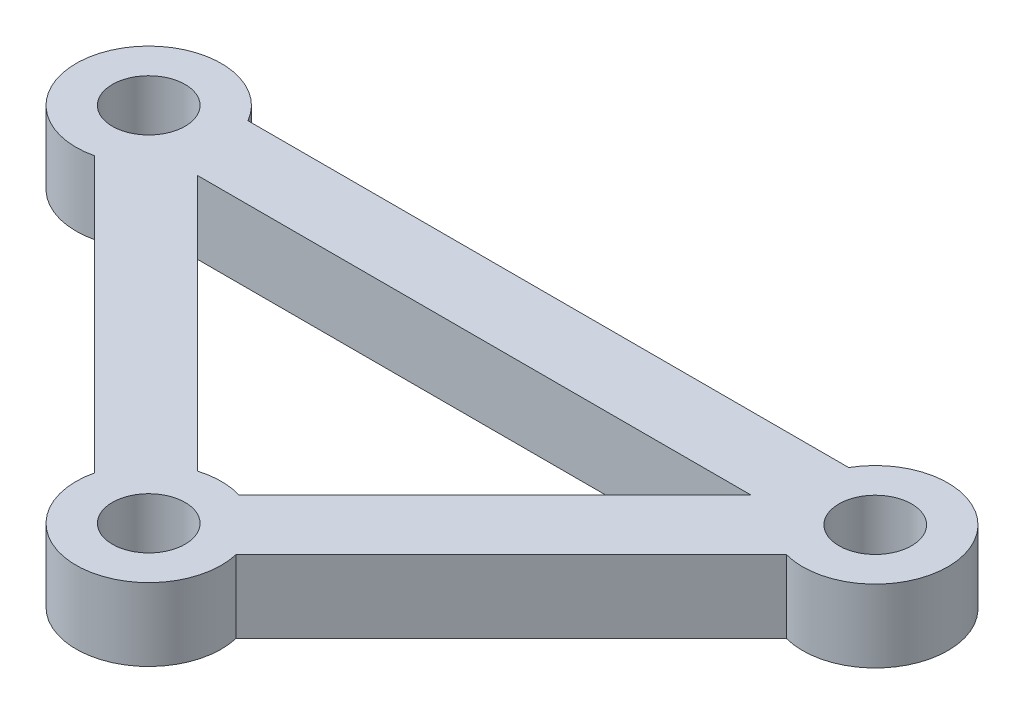
ISO-10303-21;
HEADER;
FILE_DESCRIPTION(('STEP AP214'),'2;1');
FILE_NAME('part.step','',(''),(''),'','','');
FILE_SCHEMA(('AUTOMOTIVE_DESIGN { 1 0 10303 214 1 1 1 1 }'));
ENDSEC;
DATA;
#1=APPLICATION_CONTEXT('core data for automotive mechanical design processes');
#2=APPLICATION_PROTOCOL_DEFINITION('international standard','automotive_design',2000,#1);
#3=PRODUCT_CONTEXT('',#1,'mechanical');
#4=PRODUCT('Part','Part','',(#3));
#5=PRODUCT_RELATED_PRODUCT_CATEGORY('part','',(#4));
#6=PRODUCT_DEFINITION_FORMATION('','',#4);
#7=PRODUCT_DEFINITION_CONTEXT('part definition',#1,'design');
#8=PRODUCT_DEFINITION('design','',#6,#7);
#9=PRODUCT_DEFINITION_SHAPE('','',#8);
#10=(LENGTH_UNIT() NAMED_UNIT(*) SI_UNIT(.MILLI.,.METRE.));
#11=(NAMED_UNIT(*) PLANE_ANGLE_UNIT() SI_UNIT($,.RADIAN.));
#12=(NAMED_UNIT(*) SI_UNIT($,.STERADIAN.) SOLID_ANGLE_UNIT());
#13=UNCERTAINTY_MEASURE_WITH_UNIT(LENGTH_MEASURE(1.E-05),#10,'distance_accuracy_value','');
#14=(GEOMETRIC_REPRESENTATION_CONTEXT(3) GLOBAL_UNCERTAINTY_ASSIGNED_CONTEXT((#13)) GLOBAL_UNIT_ASSIGNED_CONTEXT((#10,
#11,#12)) REPRESENTATION_CONTEXT('',''));
#15=CARTESIAN_POINT('',(0.,0.,0.));
#16=DIRECTION('',(0.,0.,1.));
#17=DIRECTION('',(1.,0.,0.));
#18=AXIS2_PLACEMENT_3D('',#15,#16,#17);
#19=CARTESIAN_POINT('',(-36.6,5.,-18.4290320670353));
#20=DIRECTION('',(0.,1.,0.));
#21=DIRECTION('',(0.,0.,1.));
#22=AXIS2_PLACEMENT_3D('',#19,#20,#21);
#23=PLANE('',#22);
#24=CARTESIAN_POINT('',(13.4,5.,-18.4290320670353));
#25=DIRECTION('',(0.,1.,0.));
#26=DIRECTION('',(0.,0.,1.));
#27=AXIS2_PLACEMENT_3D('',#24,#25,#26);
#28=CIRCLE('',#27,2.49999999999999);
#29=CARTESIAN_POINT('',(13.4,5.,-15.9290320670353));
#30=VERTEX_POINT('',#29);
#31=EDGE_CURVE('E262',#30,#30,#28,.T.);
#32=ORIENTED_EDGE('',*,*,#31,.F.);
#33=EDGE_LOOP('',(#32));
#34=FACE_BOUND('',#33,.T.);
#35=CARTESIAN_POINT('',(-36.6,5.,-18.4290320670353));
#36=DIRECTION('',(0.,1.,0.));
#37=DIRECTION('',(0.,0.,1.));
#38=AXIS2_PLACEMENT_3D('',#35,#36,#37);
#39=CIRCLE('',#38,2.49999999999999);
#40=CARTESIAN_POINT('',(-36.6,5.,-15.9290320670353));
#41=VERTEX_POINT('',#40);
#42=EDGE_CURVE('E264',#41,#41,#39,.T.);
#43=ORIENTED_EDGE('',*,*,#42,.F.);
#44=EDGE_LOOP('',(#43));
#45=FACE_BOUND('',#44,.T.);
#46=CARTESIAN_POINT('',(-11.6900924905343,5.,6.48054959979383));
#47=DIRECTION('',(0.,1.,0.));
#48=DIRECTION('',(0.,0.,1.));
#49=AXIS2_PLACEMENT_3D('',#46,#47,#48);
#50=CIRCLE('',#49,2.49999999999999);
#51=CARTESIAN_POINT('',(-11.6900924905343,5.,8.98054959979382));
#52=VERTEX_POINT('',#51);
#53=EDGE_CURVE('E272',#52,#52,#50,.T.);
#54=ORIENTED_EDGE('',*,*,#53,.F.);
#55=EDGE_LOOP('',(#54));
#56=FACE_BOUND('',#55,.T.);
#57=CARTESIAN_POINT('',(-36.6,5.,-18.4290320670353));
#58=DIRECTION('',(0.,1.,0.));
#59=DIRECTION('',(0.,0.,1.));
#60=AXIS2_PLACEMENT_3D('',#57,#58,#59);
#61=CIRCLE('',#60,5.);
#62=CARTESIAN_POINT('',(-32.2698729810778,5.,-20.9290320670353));
#63=VERTEX_POINT('',#62);
#64=CARTESIAN_POINT('',(-35.4498105263129,5.,-13.5631237063467));
#65=VERTEX_POINT('',#64);
#66=EDGE_CURVE('E148',#63,#65,#61,.T.);
#67=ORIENTED_EDGE('',*,*,#66,.T.);
#68=DIRECTION('',(0.707106781186549,0.,0.707106781186546));
#69=VECTOR('',#68,1.);
#70=CARTESIAN_POINT('',(-35.4498105263129,5.,-13.5631237063467));
#71=LINE('',#70,#69);
#72=CARTESIAN_POINT('',(-16.55606314145,5.,5.33062367851603));
#73=VERTEX_POINT('',#72);
#74=EDGE_CURVE('E151',#65,#73,#71,.T.);
#75=ORIENTED_EDGE('',*,*,#74,.T.);
#76=CARTESIAN_POINT('',(-11.6900924905343,5.,6.48054959979383));
#77=DIRECTION('',(0.,1.,0.));
#78=DIRECTION('',(0.,0.,1.));
#79=AXIS2_PLACEMENT_3D('',#76,#77,#78);
#80=CIRCLE('',#79,4.99999999999999);
#81=CARTESIAN_POINT('',(-6.82412183961866,5.,5.33062367851576));
#82=VERTEX_POINT('',#81);
#83=EDGE_CURVE('E154',#73,#82,#80,.T.);
#84=ORIENTED_EDGE('',*,*,#83,.T.);
#85=DIRECTION('',(0.707106781186553,0.,-0.707106781186542));
#86=VECTOR('',#85,1.);
#87=CARTESIAN_POINT('',(12.1059047744874,5.,-13.59940293559));
#88=LINE('',#87,#86);
#89=CARTESIAN_POINT('',(12.1059047744874,5.,-13.59940293559));
#90=VERTEX_POINT('',#89);
#91=EDGE_CURVE('E156',#82,#90,#88,.T.);
#92=ORIENTED_EDGE('',*,*,#91,.T.);
#93=CARTESIAN_POINT('',(13.4,5.,-18.4290320670353));
#94=DIRECTION('',(0.,1.,0.));
#95=DIRECTION('',(0.,0.,1.));
#96=AXIS2_PLACEMENT_3D('',#93,#94,#95);
#97=CIRCLE('',#96,5.);
#98=CARTESIAN_POINT('',(9.06987298107782,5.,-20.9290320670353));
#99=VERTEX_POINT('',#98);
#100=EDGE_CURVE('E158',#90,#99,#97,.T.);
#101=ORIENTED_EDGE('',*,*,#100,.T.);
#102=DIRECTION('',(-1.,0.,0.));
#103=VECTOR('',#102,1.);
#104=CARTESIAN_POINT('',(-32.2698729810778,5.,-20.9290320670353));
#105=LINE('',#104,#103);
#106=EDGE_CURVE('E160',#99,#63,#105,.T.);
#107=ORIENTED_EDGE('',*,*,#106,.T.);
#108=EDGE_LOOP('',(#67,#75,#84,#92,#101,#107));
#109=FACE_BOUND('',#108,.T.);
#110=CARTESIAN_POINT('',(-11.6900924905343,5.,6.48054959979383));
#111=DIRECTION('',(0.,-1.,0.));
#112=DIRECTION('',(0.,0.,1.));
#113=AXIS2_PLACEMENT_3D('',#110,#111,#112);
#114=CIRCLE('',#113,5.00000000000001);
#115=CARTESIAN_POINT('',(-13.1248076489767,5.,1.6908113591239));
#116=VERTEX_POINT('',#115);
#117=CARTESIAN_POINT('',(-10.2553773320922,5.,1.69081135912383));
#118=VERTEX_POINT('',#117);
#119=EDGE_CURVE('E118',#116,#118,#114,.T.);
#120=ORIENTED_EDGE('',*,*,#119,.F.);
#121=DIRECTION('',(0.70710678118655,0.,0.707106781186545));
#122=VECTOR('',#121,1.);
#123=CARTESIAN_POINT('',(-30.744651075136,5.,-15.9290320670353));
#124=LINE('',#123,#122);
#125=CARTESIAN_POINT('',(-30.744651075136,5.,-15.9290320670353));
#126=VERTEX_POINT('',#125);
#127=EDGE_CURVE('E110',#126,#116,#124,.T.);
#128=ORIENTED_EDGE('',*,*,#127,.F.);
#129=DIRECTION('',(-1.,0.,0.));
#130=VECTOR('',#129,1.);
#131=CARTESIAN_POINT('',(-30.744651075136,5.,-15.9290320670353));
#132=LINE('',#131,#130);
#133=CARTESIAN_POINT('',(7.36446609406724,5.,-15.9290320670353));
#134=VERTEX_POINT('',#133);
#135=EDGE_CURVE('E132',#134,#126,#132,.T.);
#136=ORIENTED_EDGE('',*,*,#135,.F.);
#137=DIRECTION('',(0.707106781186554,0.,-0.707106781186541));
#138=VECTOR('',#137,1.);
#139=CARTESIAN_POINT('',(7.36446609406724,5.,-15.9290320670353));
#140=LINE('',#139,#138);
#141=EDGE_CURVE('E130',#118,#134,#140,.T.);
#142=ORIENTED_EDGE('',*,*,#141,.F.);
#143=EDGE_LOOP('',(#120,#128,#136,#142));
#144=FACE_BOUND('',#143,.T.);
#145=ADVANCED_FACE('F33',(#34,#45,#56,#109,#144),#23,.T.);
#146=CARTESIAN_POINT('',(-36.6,0.,-18.4290320670353));
#147=DIRECTION('',(0.,1.,0.));
#148=DIRECTION('',(0.,0.,1.));
#149=AXIS2_PLACEMENT_3D('',#146,#147,#148);
#150=PLANE('',#149);
#151=CARTESIAN_POINT('',(13.4,0.,-18.4290320670353));
#152=DIRECTION('',(0.,1.,0.));
#153=DIRECTION('',(0.,0.,1.));
#154=AXIS2_PLACEMENT_3D('',#151,#152,#153);
#155=CIRCLE('',#154,2.5);
#156=CARTESIAN_POINT('',(13.4,0.,-15.9290320670353));
#157=VERTEX_POINT('',#156);
#158=EDGE_CURVE('E260',#157,#157,#155,.T.);
#159=ORIENTED_EDGE('',*,*,#158,.T.);
#160=EDGE_LOOP('',(#159));
#161=FACE_BOUND('',#160,.T.);
#162=CARTESIAN_POINT('',(-36.6,0.,-18.4290320670353));
#163=DIRECTION('',(0.,1.,0.));
#164=DIRECTION('',(0.,0.,1.));
#165=AXIS2_PLACEMENT_3D('',#162,#163,#164);
#166=CIRCLE('',#165,2.5);
#167=CARTESIAN_POINT('',(-36.6,0.,-15.9290320670353));
#168=VERTEX_POINT('',#167);
#169=EDGE_CURVE('E269',#168,#168,#166,.T.);
#170=ORIENTED_EDGE('',*,*,#169,.T.);
#171=EDGE_LOOP('',(#170));
#172=FACE_BOUND('',#171,.T.);
#173=CARTESIAN_POINT('',(-11.6900924905343,0.,6.48054959979383));
#174=DIRECTION('',(0.,1.,0.));
#175=DIRECTION('',(0.,0.,1.));
#176=AXIS2_PLACEMENT_3D('',#173,#174,#175);
#177=CIRCLE('',#176,2.5);
#178=CARTESIAN_POINT('',(-11.6900924905343,0.,8.98054959979383));
#179=VERTEX_POINT('',#178);
#180=EDGE_CURVE('E138',#179,#179,#177,.T.);
#181=ORIENTED_EDGE('',*,*,#180,.T.);
#182=EDGE_LOOP('',(#181));
#183=FACE_BOUND('',#182,.T.);
#184=CARTESIAN_POINT('',(-36.6,0.,-18.4290320670353));
#185=DIRECTION('',(0.,1.,0.));
#186=DIRECTION('',(0.,0.,1.));
#187=AXIS2_PLACEMENT_3D('',#184,#185,#186);
#188=CIRCLE('',#187,5.);
#189=CARTESIAN_POINT('',(-32.2698729810778,0.,-20.9290320670353));
#190=VERTEX_POINT('',#189);
#191=CARTESIAN_POINT('',(-35.4498105263129,0.,-13.5631237063467));
#192=VERTEX_POINT('',#191);
#193=EDGE_CURVE('E126',#190,#192,#188,.T.);
#194=ORIENTED_EDGE('',*,*,#193,.F.);
#195=DIRECTION('',(-1.,0.,0.));
#196=VECTOR('',#195,1.);
#197=CARTESIAN_POINT('',(-32.2698729810778,0.,-20.9290320670353));
#198=LINE('',#197,#196);
#199=CARTESIAN_POINT('',(9.06987298107782,0.,-20.9290320670353));
#200=VERTEX_POINT('',#199);
#201=EDGE_CURVE('E152',#200,#190,#198,.T.);
#202=ORIENTED_EDGE('',*,*,#201,.F.);
#203=CARTESIAN_POINT('',(13.4,0.,-18.4290320670353));
#204=DIRECTION('',(0.,1.,0.));
#205=DIRECTION('',(0.,0.,1.));
#206=AXIS2_PLACEMENT_3D('',#203,#204,#205);
#207=CIRCLE('',#206,5.);
#208=CARTESIAN_POINT('',(12.1059047744874,0.,-13.59940293559));
#209=VERTEX_POINT('',#208);
#210=EDGE_CURVE('E171',#209,#200,#207,.T.);
#211=ORIENTED_EDGE('',*,*,#210,.F.);
#212=DIRECTION('',(0.707106781186553,0.,-0.707106781186542));
#213=VECTOR('',#212,1.);
#214=CARTESIAN_POINT('',(12.1059047744874,0.,-13.59940293559));
#215=LINE('',#214,#213);
#216=CARTESIAN_POINT('',(-6.82412183961866,0.,5.33062367851576));
#217=VERTEX_POINT('',#216);
#218=EDGE_CURVE('E169',#217,#209,#215,.T.);
#219=ORIENTED_EDGE('',*,*,#218,.F.);
#220=CARTESIAN_POINT('',(-11.6900924905343,0.,6.48054959979383));
#221=DIRECTION('',(0.,1.,0.));
#222=DIRECTION('',(0.,0.,1.));
#223=AXIS2_PLACEMENT_3D('',#220,#221,#222);
#224=CIRCLE('',#223,4.99999999999999);
#225=CARTESIAN_POINT('',(-16.55606314145,0.,5.33062367851603));
#226=VERTEX_POINT('',#225);
#227=EDGE_CURVE('E167',#226,#217,#224,.T.);
#228=ORIENTED_EDGE('',*,*,#227,.F.);
#229=DIRECTION('',(0.707106781186549,0.,0.707106781186546));
#230=VECTOR('',#229,1.);
#231=CARTESIAN_POINT('',(-35.4498105263129,0.,-13.5631237063467));
#232=LINE('',#231,#230);
#233=EDGE_CURVE('E165',#192,#226,#232,.T.);
#234=ORIENTED_EDGE('',*,*,#233,.F.);
#235=EDGE_LOOP('',(#194,#202,#211,#219,#228,#234));
#236=FACE_BOUND('',#235,.T.);
#237=DIRECTION('',(0.70710678118655,0.,0.707106781186545));
#238=VECTOR('',#237,1.);
#239=CARTESIAN_POINT('',(-30.744651075136,0.,-15.9290320670353));
#240=LINE('',#239,#238);
#241=CARTESIAN_POINT('',(-30.744651075136,0.,-15.9290320670353));
#242=VERTEX_POINT('',#241);
#243=CARTESIAN_POINT('',(-13.1248076489767,0.,1.6908113591239));
#244=VERTEX_POINT('',#243);
#245=EDGE_CURVE('E56',#242,#244,#240,.T.);
#246=ORIENTED_EDGE('',*,*,#245,.T.);
#247=CARTESIAN_POINT('',(-11.6900924905343,0.,6.48054959979383));
#248=DIRECTION('',(0.,-1.,0.));
#249=DIRECTION('',(0.,0.,1.));
#250=AXIS2_PLACEMENT_3D('',#247,#248,#249);
#251=CIRCLE('',#250,5.00000000000001);
#252=CARTESIAN_POINT('',(-10.2553773320922,0.,1.69081135912383));
#253=VERTEX_POINT('',#252);
#254=EDGE_CURVE('E125',#244,#253,#251,.T.);
#255=ORIENTED_EDGE('',*,*,#254,.T.);
#256=DIRECTION('',(0.707106781186554,0.,-0.707106781186541));
#257=VECTOR('',#256,1.);
#258=CARTESIAN_POINT('',(7.36446609406724,0.,-15.9290320670353));
#259=LINE('',#258,#257);
#260=CARTESIAN_POINT('',(7.36446609406724,0.,-15.9290320670353));
#261=VERTEX_POINT('',#260);
#262=EDGE_CURVE('E140',#253,#261,#259,.T.);
#263=ORIENTED_EDGE('',*,*,#262,.T.);
#264=DIRECTION('',(-1.,0.,0.));
#265=VECTOR('',#264,1.);
#266=CARTESIAN_POINT('',(-30.744651075136,0.,-15.9290320670353));
#267=LINE('',#266,#265);
#268=EDGE_CURVE('E119',#261,#242,#267,.T.);
#269=ORIENTED_EDGE('',*,*,#268,.T.);
#270=EDGE_LOOP('',(#246,#255,#263,#269));
#271=FACE_BOUND('',#270,.T.);
#272=ADVANCED_FACE('F195',(#161,#172,#183,#236,#271),#150,.F.);
#273=CARTESIAN_POINT('',(-36.6,5.,-18.4290320670353));
#274=DIRECTION('',(0.,-1.,0.));
#275=DIRECTION('',(0.,0.,-1.));
#276=AXIS2_PLACEMENT_3D('',#273,#274,#275);
#277=CYLINDRICAL_SURFACE('',#276,5.);
#278=ORIENTED_EDGE('',*,*,#193,.T.);
#279=DIRECTION('',(0.,-1.,0.));
#280=VECTOR('',#279,1.);
#281=CARTESIAN_POINT('',(-35.4498105263129,5.,-13.5631237063467));
#282=LINE('',#281,#280);
#283=EDGE_CURVE('E11',#65,#192,#282,.T.);
#284=ORIENTED_EDGE('',*,*,#283,.F.);
#285=ORIENTED_EDGE('',*,*,#66,.F.);
#286=DIRECTION('',(0.,-1.,0.));
#287=VECTOR('',#286,1.);
#288=CARTESIAN_POINT('',(-32.2698729810778,5.,-20.9290320670353));
#289=LINE('',#288,#287);
#290=EDGE_CURVE('E162',#63,#190,#289,.T.);
#291=ORIENTED_EDGE('',*,*,#290,.T.);
#292=EDGE_LOOP('',(#278,#284,#285,#291));
#293=FACE_BOUND('',#292,.T.);
#294=ADVANCED_FACE('F35',(#293),#277,.T.);
#295=CARTESIAN_POINT('',(-35.4498105263129,5.,-13.5631237063467));
#296=DIRECTION('',(0.707106781186546,0.,-0.707106781186549));
#297=DIRECTION('',(-0.707106781186549,0.,-0.707106781186546));
#298=AXIS2_PLACEMENT_3D('',#295,#296,#297);
#299=PLANE('',#298);
#300=ORIENTED_EDGE('',*,*,#233,.T.);
#301=DIRECTION('',(0.,-1.,0.));
#302=VECTOR('',#301,1.);
#303=CARTESIAN_POINT('',(-16.55606314145,5.,5.33062367851603));
#304=LINE('',#303,#302);
#305=EDGE_CURVE('E41',#73,#226,#304,.T.);
#306=ORIENTED_EDGE('',*,*,#305,.F.);
#307=ORIENTED_EDGE('',*,*,#74,.F.);
#308=ORIENTED_EDGE('',*,*,#283,.T.);
#309=EDGE_LOOP('',(#300,#306,#307,#308));
#310=FACE_BOUND('',#309,.T.);
#311=ADVANCED_FACE('F212',(#310),#299,.F.);
#312=CARTESIAN_POINT('',(-11.6900924905343,5.,6.48054959979383));
#313=DIRECTION('',(0.,-1.,0.));
#314=DIRECTION('',(0.,0.,-1.));
#315=AXIS2_PLACEMENT_3D('',#312,#313,#314);
#316=CYLINDRICAL_SURFACE('',#315,4.99999999999999);
#317=ORIENTED_EDGE('',*,*,#227,.T.);
#318=DIRECTION('',(0.,-1.,0.));
#319=VECTOR('',#318,1.);
#320=CARTESIAN_POINT('',(-6.82412183961866,5.,5.33062367851576));
#321=LINE('',#320,#319);
#322=EDGE_CURVE('E182',#82,#217,#321,.T.);
#323=ORIENTED_EDGE('',*,*,#322,.F.);
#324=ORIENTED_EDGE('',*,*,#83,.F.);
#325=ORIENTED_EDGE('',*,*,#305,.T.);
#326=EDGE_LOOP('',(#317,#323,#324,#325));
#327=FACE_BOUND('',#326,.T.);
#328=ADVANCED_FACE('F189',(#327),#316,.T.);
#329=CARTESIAN_POINT('',(12.1059047744874,5.,-13.59940293559));
#330=DIRECTION('',(-0.707106781186542,0.,-0.707106781186553));
#331=DIRECTION('',(-0.707106781186553,0.,0.707106781186542));
#332=AXIS2_PLACEMENT_3D('',#329,#330,#331);
#333=PLANE('',#332);
#334=ORIENTED_EDGE('',*,*,#218,.T.);
#335=DIRECTION('',(0.,-1.,0.));
#336=VECTOR('',#335,1.);
#337=CARTESIAN_POINT('',(12.1059047744874,5.,-13.59940293559));
#338=LINE('',#337,#336);
#339=EDGE_CURVE('E179',#90,#209,#338,.T.);
#340=ORIENTED_EDGE('',*,*,#339,.F.);
#341=ORIENTED_EDGE('',*,*,#91,.F.);
#342=ORIENTED_EDGE('',*,*,#322,.T.);
#343=EDGE_LOOP('',(#334,#340,#341,#342));
#344=FACE_BOUND('',#343,.T.);
#345=ADVANCED_FACE('F201',(#344),#333,.F.);
#346=CARTESIAN_POINT('',(13.4,5.,-18.4290320670353));
#347=DIRECTION('',(0.,-1.,0.));
#348=DIRECTION('',(0.,0.,-1.));
#349=AXIS2_PLACEMENT_3D('',#346,#347,#348);
#350=CYLINDRICAL_SURFACE('',#349,5.);
#351=ORIENTED_EDGE('',*,*,#210,.T.);
#352=DIRECTION('',(0.,-1.,0.));
#353=VECTOR('',#352,1.);
#354=CARTESIAN_POINT('',(9.06987298107782,5.,-20.9290320670353));
#355=LINE('',#354,#353);
#356=EDGE_CURVE('E176',#99,#200,#355,.T.);
#357=ORIENTED_EDGE('',*,*,#356,.F.);
#358=ORIENTED_EDGE('',*,*,#100,.F.);
#359=ORIENTED_EDGE('',*,*,#339,.T.);
#360=EDGE_LOOP('',(#351,#357,#358,#359));
#361=FACE_BOUND('',#360,.T.);
#362=ADVANCED_FACE('F205',(#361),#350,.T.);
#363=CARTESIAN_POINT('',(-32.2698729810778,5.,-20.9290320670353));
#364=DIRECTION('',(0.,0.,1.));
#365=DIRECTION('',(1.,0.,0.));
#366=AXIS2_PLACEMENT_3D('',#363,#364,#365);
#367=PLANE('',#366);
#368=ORIENTED_EDGE('',*,*,#201,.T.);
#369=ORIENTED_EDGE('',*,*,#290,.F.);
#370=ORIENTED_EDGE('',*,*,#106,.F.);
#371=ORIENTED_EDGE('',*,*,#356,.T.);
#372=EDGE_LOOP('',(#368,#369,#370,#371));
#373=FACE_BOUND('',#372,.T.);
#374=ADVANCED_FACE('F215',(#373),#367,.F.);
#375=CARTESIAN_POINT('',(-30.744651075136,5.,-15.9290320670353));
#376=DIRECTION('',(0.707106781186545,0.,-0.70710678118655));
#377=DIRECTION('',(-0.70710678118655,0.,-0.707106781186545));
#378=AXIS2_PLACEMENT_3D('',#375,#376,#377);
#379=PLANE('',#378);
#380=ORIENTED_EDGE('',*,*,#245,.F.);
#381=DIRECTION('',(0.,-1.,0.));
#382=VECTOR('',#381,1.);
#383=CARTESIAN_POINT('',(-30.744651075136,5.,-15.9290320670353));
#384=LINE('',#383,#382);
#385=EDGE_CURVE('E114',#126,#242,#384,.T.);
#386=ORIENTED_EDGE('',*,*,#385,.F.);
#387=ORIENTED_EDGE('',*,*,#127,.T.);
#388=DIRECTION('',(0.,-1.,0.));
#389=VECTOR('',#388,1.);
#390=CARTESIAN_POINT('',(-13.1248076489767,5.,1.6908113591239));
#391=LINE('',#390,#389);
#392=EDGE_CURVE('E113',#116,#244,#391,.T.);
#393=ORIENTED_EDGE('',*,*,#392,.T.);
#394=EDGE_LOOP('',(#380,#386,#387,#393));
#395=FACE_BOUND('',#394,.T.);
#396=ADVANCED_FACE('F112',(#395),#379,.T.);
#397=CARTESIAN_POINT('',(-11.6900924905343,5.,6.48054959979383));
#398=DIRECTION('',(0.,-1.,0.));
#399=DIRECTION('',(0.,0.,-1.));
#400=AXIS2_PLACEMENT_3D('',#397,#398,#399);
#401=CYLINDRICAL_SURFACE('',#400,5.00000000000001);
#402=ORIENTED_EDGE('',*,*,#254,.F.);
#403=ORIENTED_EDGE('',*,*,#392,.F.);
#404=ORIENTED_EDGE('',*,*,#119,.T.);
#405=DIRECTION('',(0.,-1.,0.));
#406=VECTOR('',#405,1.);
#407=CARTESIAN_POINT('',(-10.2553773320922,5.,1.69081135912383));
#408=LINE('',#407,#406);
#409=EDGE_CURVE('E127',#118,#253,#408,.T.);
#410=ORIENTED_EDGE('',*,*,#409,.T.);
#411=EDGE_LOOP('',(#402,#403,#404,#410));
#412=FACE_BOUND('',#411,.T.);
#413=ADVANCED_FACE('F122',(#412),#401,.T.);
#414=CARTESIAN_POINT('',(7.36446609406724,5.,-15.9290320670353));
#415=DIRECTION('',(-0.707106781186541,0.,-0.707106781186554));
#416=DIRECTION('',(-0.707106781186554,0.,0.707106781186541));
#417=AXIS2_PLACEMENT_3D('',#414,#415,#416);
#418=PLANE('',#417);
#419=ORIENTED_EDGE('',*,*,#262,.F.);
#420=ORIENTED_EDGE('',*,*,#409,.F.);
#421=ORIENTED_EDGE('',*,*,#141,.T.);
#422=DIRECTION('',(0.,-1.,0.));
#423=VECTOR('',#422,1.);
#424=CARTESIAN_POINT('',(7.36446609406724,5.,-15.9290320670353));
#425=LINE('',#424,#423);
#426=EDGE_CURVE('E48',#134,#261,#425,.T.);
#427=ORIENTED_EDGE('',*,*,#426,.T.);
#428=EDGE_LOOP('',(#419,#420,#421,#427));
#429=FACE_BOUND('',#428,.T.);
#430=ADVANCED_FACE('F237',(#429),#418,.T.);
#431=CARTESIAN_POINT('',(-30.744651075136,5.,-15.9290320670353));
#432=DIRECTION('',(0.,0.,1.));
#433=DIRECTION('',(1.,0.,0.));
#434=AXIS2_PLACEMENT_3D('',#431,#432,#433);
#435=PLANE('',#434);
#436=ORIENTED_EDGE('',*,*,#268,.F.);
#437=ORIENTED_EDGE('',*,*,#426,.F.);
#438=ORIENTED_EDGE('',*,*,#135,.T.);
#439=ORIENTED_EDGE('',*,*,#385,.T.);
#440=EDGE_LOOP('',(#436,#437,#438,#439));
#441=FACE_BOUND('',#440,.T.);
#442=ADVANCED_FACE('F240',(#441),#435,.T.);
#443=CARTESIAN_POINT('',(-11.6900924905343,5.,6.48054959979383));
#444=DIRECTION('',(0.,1.,0.));
#445=DIRECTION('',(0.,0.,1.));
#446=AXIS2_PLACEMENT_3D('',#443,#444,#445);
#447=CYLINDRICAL_SURFACE('',#446,2.49999999999999);
#448=ORIENTED_EDGE('',*,*,#180,.F.);
#449=EDGE_LOOP('',(#448));
#450=FACE_BOUND('',#449,.T.);
#451=ORIENTED_EDGE('',*,*,#53,.T.);
#452=EDGE_LOOP('',(#451));
#453=FACE_BOUND('',#452,.T.);
#454=ADVANCED_FACE('F244',(#450,#453),#447,.F.);
#455=CARTESIAN_POINT('',(-36.6,5.,-18.4290320670353));
#456=DIRECTION('',(0.,1.,0.));
#457=DIRECTION('',(0.,0.,1.));
#458=AXIS2_PLACEMENT_3D('',#455,#456,#457);
#459=CYLINDRICAL_SURFACE('',#458,2.5);
#460=ORIENTED_EDGE('',*,*,#169,.F.);
#461=EDGE_LOOP('',(#460));
#462=FACE_BOUND('',#461,.T.);
#463=ORIENTED_EDGE('',*,*,#42,.T.);
#464=EDGE_LOOP('',(#463));
#465=FACE_BOUND('',#464,.T.);
#466=ADVANCED_FACE('F247',(#462,#465),#459,.F.);
#467=CARTESIAN_POINT('',(13.4,5.,-18.4290320670353));
#468=DIRECTION('',(0.,1.,0.));
#469=DIRECTION('',(0.,0.,1.));
#470=AXIS2_PLACEMENT_3D('',#467,#468,#469);
#471=CYLINDRICAL_SURFACE('',#470,2.49999999999999);
#472=ORIENTED_EDGE('',*,*,#158,.F.);
#473=EDGE_LOOP('',(#472));
#474=FACE_BOUND('',#473,.T.);
#475=ORIENTED_EDGE('',*,*,#31,.T.);
#476=EDGE_LOOP('',(#475));
#477=FACE_BOUND('',#476,.T.);
#478=ADVANCED_FACE('F251',(#474,#477),#471,.F.);
#479=CLOSED_SHELL('',(#145,#272,#294,#311,#328,#345,#362,#374,#396,#413,#430,#442,#454,#466,#478));
#480=MANIFOLD_SOLID_BREP('B2',#479);
#481=ADVANCED_BREP_SHAPE_REPRESENTATION('',(#18,#480),#14);
#482=SHAPE_DEFINITION_REPRESENTATION(#9,#481);
ENDSEC;
END-ISO-10303-21;
